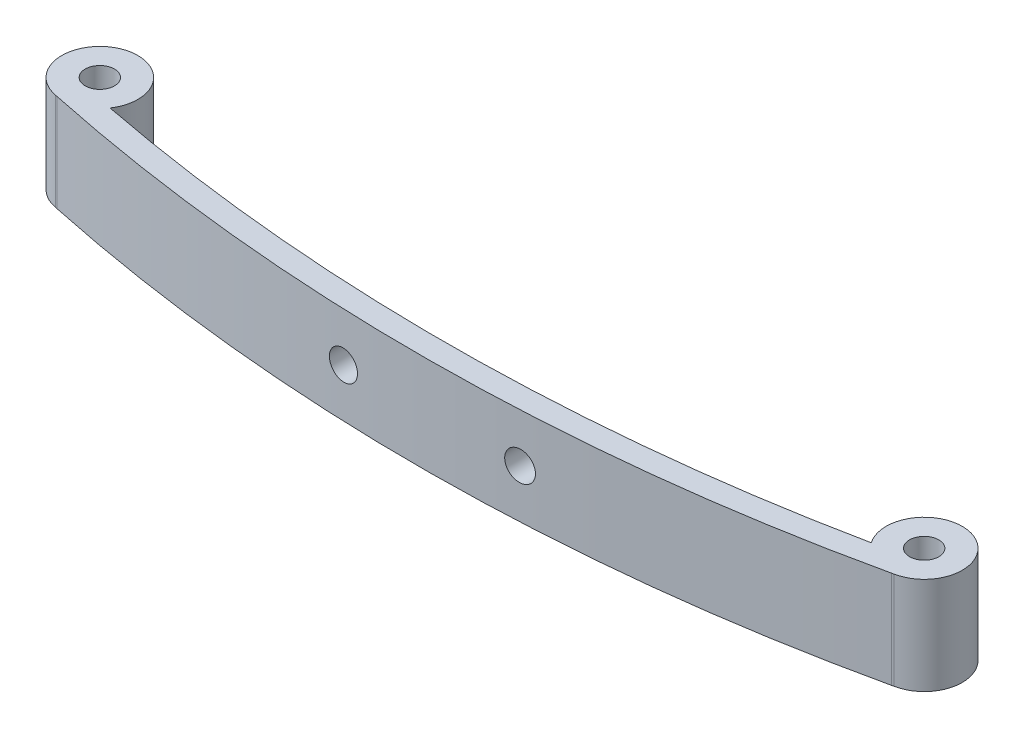
ISO-10303-21;
HEADER;
FILE_DESCRIPTION(('STEP AP214'),'2;1');
FILE_NAME('part.step','',(''),(''),'','','');
FILE_SCHEMA(('AUTOMOTIVE_DESIGN { 1 0 10303 214 1 1 1 1 }'));
ENDSEC;
DATA;
#1=APPLICATION_CONTEXT('core data for automotive mechanical design processes');
#2=APPLICATION_PROTOCOL_DEFINITION('international standard','automotive_design',2000,#1);
#3=PRODUCT_CONTEXT('',#1,'mechanical');
#4=PRODUCT('Part','Part','',(#3));
#5=PRODUCT_RELATED_PRODUCT_CATEGORY('part','',(#4));
#6=PRODUCT_DEFINITION_FORMATION('','',#4);
#7=PRODUCT_DEFINITION_CONTEXT('part definition',#1,'design');
#8=PRODUCT_DEFINITION('design','',#6,#7);
#9=PRODUCT_DEFINITION_SHAPE('','',#8);
#10=(LENGTH_UNIT() NAMED_UNIT(*) SI_UNIT(.MILLI.,.METRE.));
#11=(NAMED_UNIT(*) PLANE_ANGLE_UNIT() SI_UNIT($,.RADIAN.));
#12=(NAMED_UNIT(*) SI_UNIT($,.STERADIAN.) SOLID_ANGLE_UNIT());
#13=UNCERTAINTY_MEASURE_WITH_UNIT(LENGTH_MEASURE(1.E-05),#10,'distance_accuracy_value','');
#14=(GEOMETRIC_REPRESENTATION_CONTEXT(3) GLOBAL_UNCERTAINTY_ASSIGNED_CONTEXT((#13)) GLOBAL_UNIT_ASSIGNED_CONTEXT((#10,
#11,#12)) REPRESENTATION_CONTEXT('',''));
#15=CARTESIAN_POINT('',(0.,0.,0.));
#16=DIRECTION('',(0.,0.,1.));
#17=DIRECTION('',(1.,0.,0.));
#18=AXIS2_PLACEMENT_3D('',#15,#16,#17);
#19=CARTESIAN_POINT('',(-0.864955357142889,8.3,-164.510629845203));
#20=DIRECTION('',(0.,1.,0.));
#21=DIRECTION('',(0.,0.,1.));
#22=AXIS2_PLACEMENT_3D('',#19,#20,#21);
#23=PLANE('',#22);
#24=CARTESIAN_POINT('',(-35.,8.3,-4.14258073909656));
#25=DIRECTION('',(0.,1.,0.));
#26=DIRECTION('',(0.,0.,1.));
#27=AXIS2_PLACEMENT_3D('',#24,#25,#26);
#28=CIRCLE('',#27,1.25);
#29=CARTESIAN_POINT('',(-35.,8.3,-2.89258073909657));
#30=VERTEX_POINT('',#29);
#31=EDGE_CURVE('E134',#30,#30,#28,.T.);
#32=ORIENTED_EDGE('',*,*,#31,.F.);
#33=EDGE_LOOP('',(#32));
#34=FACE_BOUND('',#33,.T.);
#35=CARTESIAN_POINT('',(-0.864955357142889,8.3,-164.510629845203));
#36=DIRECTION('',(0.,-1.,0.));
#37=DIRECTION('',(0.,0.,1.));
#38=AXIS2_PLACEMENT_3D('',#35,#36,#37);
#39=CIRCLE('',#38,165.210703971618);
#40=CARTESIAN_POINT('',(32.3290587197964,8.3,-2.66893516717083));
#41=VERTEX_POINT('',#40);
#42=CARTESIAN_POINT('',(-32.3092176120712,8.3,-2.31989312438794));
#43=VERTEX_POINT('',#42);
#44=EDGE_CURVE('E141',#41,#43,#39,.T.);
#45=ORIENTED_EDGE('',*,*,#44,.T.);
#46=CARTESIAN_POINT('',(-35.,8.3,-4.14258073909656));
#47=DIRECTION('',(0.,1.,0.));
#48=DIRECTION('',(0.,0.,1.));
#49=AXIS2_PLACEMENT_3D('',#46,#47,#48);
#50=CIRCLE('',#49,3.25);
#51=CARTESIAN_POINT('',(-35.5757158370828,8.3,-0.943979283001734));
#52=VERTEX_POINT('',#51);
#53=EDGE_CURVE('E99',#43,#52,#50,.T.);
#54=ORIENTED_EDGE('',*,*,#53,.T.);
#55=DIRECTION('',(0.97628943196104,0.,0.216469270431603));
#56=VECTOR('',#55,1.);
#57=CARTESIAN_POINT('',(-35.413230424207,8.3,-0.907951955828518));
#58=LINE('',#57,#56);
#59=CARTESIAN_POINT('',(-35.413230424207,8.3,-0.907951955828545));
#60=VERTEX_POINT('',#59);
#61=EDGE_CURVE('E112',#52,#60,#58,.T.);
#62=ORIENTED_EDGE('',*,*,#61,.T.);
#63=CARTESIAN_POINT('',(-0.864955357142889,8.3,-164.510629845203));
#64=DIRECTION('',(0.,1.,0.));
#65=DIRECTION('',(0.,0.,1.));
#66=AXIS2_PLACEMENT_3D('',#63,#64,#65);
#67=CIRCLE('',#66,167.210703971618);
#68=CARTESIAN_POINT('',(35.4341722962853,8.3,-1.28749161325972));
#69=VERTEX_POINT('',#68);
#70=EDGE_CURVE('E106',#60,#69,#67,.T.);
#71=ORIENTED_EDGE('',*,*,#70,.T.);
#72=DIRECTION('',(0.974629450610067,0.,-0.223824560769186));
#73=VECTOR('',#72,1.);
#74=CARTESIAN_POINT('',(35.4341722962853,8.3,-1.28749161325972));
#75=LINE('',#74,#73);
#76=CARTESIAN_POINT('',(35.6227279714257,8.3,-1.33079359961198));
#77=VERTEX_POINT('',#76);
#78=EDGE_CURVE('E110',#69,#77,#75,.T.);
#79=ORIENTED_EDGE('',*,*,#78,.T.);
#80=CARTESIAN_POINT('',(35.,8.3,-4.52057570402037));
#81=DIRECTION('',(0.,1.,0.));
#82=DIRECTION('',(0.,0.,1.));
#83=AXIS2_PLACEMENT_3D('',#80,#81,#82);
#84=CIRCLE('',#83,3.25);
#85=EDGE_CURVE('E62',#77,#41,#84,.T.);
#86=ORIENTED_EDGE('',*,*,#85,.T.);
#87=EDGE_LOOP('',(#45,#54,#62,#71,#79,#86));
#88=FACE_BOUND('',#87,.T.);
#89=CARTESIAN_POINT('',(35.,8.3,-4.52057570402037));
#90=DIRECTION('',(0.,1.,0.));
#91=DIRECTION('',(0.,0.,1.));
#92=AXIS2_PLACEMENT_3D('',#89,#90,#91);
#93=CIRCLE('',#92,1.25);
#94=CARTESIAN_POINT('',(35.,8.3,-3.27057570402038));
#95=VERTEX_POINT('',#94);
#96=EDGE_CURVE('E179',#95,#95,#93,.T.);
#97=ORIENTED_EDGE('',*,*,#96,.F.);
#98=EDGE_LOOP('',(#97));
#99=FACE_BOUND('',#98,.T.);
#100=ADVANCED_FACE('F37',(#34,#88,#99),#23,.T.);
#101=CARTESIAN_POINT('',(-0.864955357142889,0.,-164.510629845203));
#102=DIRECTION('',(0.,1.,0.));
#103=DIRECTION('',(0.,0.,1.));
#104=AXIS2_PLACEMENT_3D('',#101,#102,#103);
#105=PLANE('',#104);
#106=CARTESIAN_POINT('',(-0.864955357142889,0.,-164.510629845203));
#107=DIRECTION('',(0.,-1.,0.));
#108=DIRECTION('',(0.,0.,1.));
#109=AXIS2_PLACEMENT_3D('',#106,#107,#108);
#110=CIRCLE('',#109,165.210703971618);
#111=CARTESIAN_POINT('',(32.3290587197964,0.,-2.66893516717083));
#112=VERTEX_POINT('',#111);
#113=CARTESIAN_POINT('',(-32.3092176120712,0.,-2.31989312438794));
#114=VERTEX_POINT('',#113);
#115=EDGE_CURVE('E130',#112,#114,#110,.T.);
#116=ORIENTED_EDGE('',*,*,#115,.F.);
#117=CARTESIAN_POINT('',(35.,0.,-4.52057570402037));
#118=DIRECTION('',(0.,1.,0.));
#119=DIRECTION('',(0.,0.,1.));
#120=AXIS2_PLACEMENT_3D('',#117,#118,#119);
#121=CIRCLE('',#120,3.25);
#122=CARTESIAN_POINT('',(35.6227279714257,0.,-1.33079359961198));
#123=VERTEX_POINT('',#122);
#124=EDGE_CURVE('E91',#123,#112,#121,.T.);
#125=ORIENTED_EDGE('',*,*,#124,.F.);
#126=DIRECTION('',(0.974629450610067,0.,-0.223824560769186));
#127=VECTOR('',#126,1.);
#128=CARTESIAN_POINT('',(35.4341722962853,0.,-1.28749161325972));
#129=LINE('',#128,#127);
#130=CARTESIAN_POINT('',(35.4341722962853,0.,-1.28749161325972));
#131=VERTEX_POINT('',#130);
#132=EDGE_CURVE('E85',#131,#123,#129,.T.);
#133=ORIENTED_EDGE('',*,*,#132,.F.);
#134=CARTESIAN_POINT('',(-0.864955357142889,0.,-164.510629845203));
#135=DIRECTION('',(0.,1.,0.));
#136=DIRECTION('',(0.,0.,1.));
#137=AXIS2_PLACEMENT_3D('',#134,#135,#136);
#138=CIRCLE('',#137,167.210703971618);
#139=CARTESIAN_POINT('',(-35.413230424207,0.,-0.907951955828545));
#140=VERTEX_POINT('',#139);
#141=EDGE_CURVE('E120',#140,#131,#138,.T.);
#142=ORIENTED_EDGE('',*,*,#141,.F.);
#143=DIRECTION('',(0.97628943196104,0.,0.216469270431603));
#144=VECTOR('',#143,1.);
#145=CARTESIAN_POINT('',(-35.413230424207,0.,-0.907951955828518));
#146=LINE('',#145,#144);
#147=CARTESIAN_POINT('',(-35.5757158370828,0.,-0.943979283001734));
#148=VERTEX_POINT('',#147);
#149=EDGE_CURVE('E136',#148,#140,#146,.T.);
#150=ORIENTED_EDGE('',*,*,#149,.F.);
#151=CARTESIAN_POINT('',(-35.,0.,-4.14258073909656));
#152=DIRECTION('',(0.,1.,0.));
#153=DIRECTION('',(0.,0.,1.));
#154=AXIS2_PLACEMENT_3D('',#151,#152,#153);
#155=CIRCLE('',#154,3.25);
#156=EDGE_CURVE('E133',#114,#148,#155,.T.);
#157=ORIENTED_EDGE('',*,*,#156,.F.);
#158=EDGE_LOOP('',(#116,#125,#133,#142,#150,#157));
#159=FACE_BOUND('',#158,.T.);
#160=CARTESIAN_POINT('',(-35.,0.,-4.14258073909656));
#161=DIRECTION('',(0.,1.,0.));
#162=DIRECTION('',(0.,0.,1.));
#163=AXIS2_PLACEMENT_3D('',#160,#161,#162);
#164=CIRCLE('',#163,1.25);
#165=CARTESIAN_POINT('',(-35.,0.,-2.89258073909657));
#166=VERTEX_POINT('',#165);
#167=EDGE_CURVE('E182',#166,#166,#164,.T.);
#168=ORIENTED_EDGE('',*,*,#167,.T.);
#169=EDGE_LOOP('',(#168));
#170=FACE_BOUND('',#169,.T.);
#171=CARTESIAN_POINT('',(35.,0.,-4.52057570402037));
#172=DIRECTION('',(0.,1.,0.));
#173=DIRECTION('',(0.,0.,1.));
#174=AXIS2_PLACEMENT_3D('',#171,#172,#173);
#175=CIRCLE('',#174,1.25);
#176=CARTESIAN_POINT('',(35.,0.,-3.27057570402038));
#177=VERTEX_POINT('',#176);
#178=EDGE_CURVE('E178',#177,#177,#175,.T.);
#179=ORIENTED_EDGE('',*,*,#178,.T.);
#180=EDGE_LOOP('',(#179));
#181=FACE_BOUND('',#180,.T.);
#182=ADVANCED_FACE('F198',(#159,#170,#181),#105,.F.);
#183=CARTESIAN_POINT('',(-0.864955357142889,8.3,-164.510629845203));
#184=DIRECTION('',(0.,-1.,0.));
#185=DIRECTION('',(0.,0.,-1.));
#186=AXIS2_PLACEMENT_3D('',#183,#184,#185);
#187=CYLINDRICAL_SURFACE('',#186,165.210703971618);
#188=CARTESIAN_POINT('',(8.75523546801958,4.15,0.41974526891872));
#189=CARTESIAN_POINT('',(8.75523234367771,4.22012775691496,0.419745491554456));
#190=CARTESIAN_POINT('',(8.7493140129362,4.2903063866926,0.420090990830751));
#191=CARTESIAN_POINT('',(8.72578859372263,4.42872911081155,0.421460636690887));
#192=CARTESIAN_POINT('',(8.70816743840692,4.49697077385119,0.422485599990574));
#193=CARTESIAN_POINT('',(8.66174382480419,4.62949238087325,0.425173566201312));
#194=CARTESIAN_POINT('',(8.63294714461795,4.69377435227299,0.426836239390938));
#195=CARTESIAN_POINT('',(8.56500291570541,4.81657067320099,0.430734724263326));
#196=CARTESIAN_POINT('',(8.52585789764512,4.87508642805016,0.432970395816375));
#197=CARTESIAN_POINT('',(8.43828867001005,4.98476982495955,0.437932672337795));
#198=CARTESIAN_POINT('',(8.38985599940334,5.03593069179741,0.440659724815337));
#199=CARTESIAN_POINT('',(8.28510948695568,5.12939981296102,0.446503270882601));
#200=CARTESIAN_POINT('',(8.22879527493013,5.1717076512398,0.449619782763931));
#201=CARTESIAN_POINT('',(8.10979143930163,5.24633590146088,0.45613704390323));
#202=CARTESIAN_POINT('',(8.04709214420073,5.27864085376892,0.459538222916373));
#203=CARTESIAN_POINT('',(7.91716826779515,5.33226495035966,0.466505660058124));
#204=CARTESIAN_POINT('',(7.84994366214295,5.35358403552979,0.470071919074879));
#205=CARTESIAN_POINT('',(7.71279154477582,5.38465389005854,0.477259659800095));
#206=CARTESIAN_POINT('',(7.6428609508304,5.39439104119409,0.480881201455498));
#207=CARTESIAN_POINT('',(7.50235497855954,5.40197507513718,0.488066429431124));
#208=CARTESIAN_POINT('',(7.4317795997323,5.39982194869035,0.491630115706314));
#209=CARTESIAN_POINT('',(7.29196756282965,5.38368151981341,0.498600856959138));
#210=CARTESIAN_POINT('',(7.2227312745681,5.36969099469107,0.502007869016394));
#211=CARTESIAN_POINT('',(7.08758566731119,5.33026408498481,0.508576243457887));
#212=CARTESIAN_POINT('',(7.02167634432059,5.30482771414616,0.511737606137118));
#213=CARTESIAN_POINT('',(6.89509912252421,5.24324484304104,0.517738255939391));
#214=CARTESIAN_POINT('',(6.83442816188194,5.2071046546717,0.520577731514248));
#215=CARTESIAN_POINT('',(6.72001377975751,5.12513046151643,0.525875920481087));
#216=CARTESIAN_POINT('',(6.6662703199565,5.07929651035439,0.528334635979225));
#217=CARTESIAN_POINT('',(6.56729686844673,4.97928617943602,0.532821376474635));
#218=CARTESIAN_POINT('',(6.52205816339034,4.92511844250437,0.534849842550244));
#219=CARTESIAN_POINT('',(6.44131745101904,4.80994279108891,0.53844383631376));
#220=CARTESIAN_POINT('',(6.40581539141347,4.74893491334256,0.54000936648787));
#221=CARTESIAN_POINT('',(6.34559332504817,4.62187687823517,0.54265126930583));
#222=CARTESIAN_POINT('',(6.32086252862733,4.55583184494836,0.543728131497863));
#223=CARTESIAN_POINT('',(6.28283757600977,4.42052173500274,0.545379219315388));
#224=CARTESIAN_POINT('',(6.26954337213898,4.35125667176806,0.545953447036141));
#225=CARTESIAN_POINT('',(6.25477644190879,4.21152194369805,0.546591086545572));
#226=CARTESIAN_POINT('',(6.25329588598813,4.14105310771492,0.546654836656242));
#227=CARTESIAN_POINT('',(6.26217788761156,4.00086729392074,0.546271547983102));
#228=CARTESIAN_POINT('',(6.27254042347998,3.93115031473385,0.545824510134156));
#229=CARTESIAN_POINT('',(6.30480977715857,3.79446002038941,0.544425917333555));
#230=CARTESIAN_POINT('',(6.32671451735362,3.72748621379392,0.543474453179248));
#231=CARTESIAN_POINT('',(6.38144211469525,3.59816844412159,0.541080768086543));
#232=CARTESIAN_POINT('',(6.4142649785184,3.53582448387598,0.539638546848042));
#233=CARTESIAN_POINT('',(6.48990602173823,3.41751275913382,0.536285149030597));
#234=CARTESIAN_POINT('',(6.53272751484578,3.36154711768794,0.534373816969817));
#235=CARTESIAN_POINT('',(6.62714041042641,3.257599379909,0.530114926661906));
#236=CARTESIAN_POINT('',(6.67873184655798,3.20961731421781,0.527767366740558));
#237=CARTESIAN_POINT('',(6.78926149618302,3.12295724190971,0.522678091077079));
#238=CARTESIAN_POINT('',(6.84820545871927,3.08428658612228,0.519936066637596));
#239=CARTESIAN_POINT('',(6.97173301782925,3.01738849182913,0.514116300395867));
#240=CARTESIAN_POINT('',(7.0363166398803,2.98916110050416,0.511038557076984));
#241=CARTESIAN_POINT('',(7.16936208213937,2.94391906611331,0.504614561530486));
#242=CARTESIAN_POINT('',(7.23782791441387,2.92691626117345,0.501268029980191));
#243=CARTESIAN_POINT('',(7.37663371301743,2.90464766967319,0.494393542668509));
#244=CARTESIAN_POINT('',(7.44697369404434,2.89938197518744,0.490865585484106));
#245=CARTESIAN_POINT('',(7.58760200130654,2.90073423451941,0.483721398905784));
#246=CARTESIAN_POINT('',(7.65789021504032,2.90736347919335,0.480105088860304));
#247=CARTESIAN_POINT('',(7.79635468897041,2.93233884260768,0.472894251458949));
#248=CARTESIAN_POINT('',(7.86453093753108,2.95068502588915,0.469299724223171));
#249=CARTESIAN_POINT('',(7.99686289087432,2.99858525081672,0.462244531146737));
#250=CARTESIAN_POINT('',(8.06101703624891,3.02814360859774,0.458783917422253));
#251=CARTESIAN_POINT('',(8.18344997043051,3.09763154156223,0.452113922680006));
#252=CARTESIAN_POINT('',(8.24172899851644,3.13756069413193,0.448904531431768));
#253=CARTESIAN_POINT('',(8.35071784684562,3.22663140626683,0.442851648466624));
#254=CARTESIAN_POINT('',(8.4014326748975,3.27576682185215,0.44000791484301));
#255=CARTESIAN_POINT('',(8.49390354221656,3.38189250945195,0.434787242240552));
#256=CARTESIAN_POINT('',(8.535657411412,3.43888467865759,0.432410416344335));
#257=CARTESIAN_POINT('',(8.60896038366011,3.55903345604726,0.428216332520746));
#258=CARTESIAN_POINT('',(8.64051852487354,3.62218453954559,0.426398579064002));
#259=CARTESIAN_POINT('',(8.69254686909989,3.75285329662178,0.423391944263031));
#260=CARTESIAN_POINT('',(8.71303050005948,3.82036557046379,0.422202301370124));
#261=CARTESIAN_POINT('',(8.73684790490841,3.93192653704009,0.420817000107771));
#262=CARTESIAN_POINT('',(8.74373455060982,3.97524634074798,0.420415766646807));
#263=CARTESIAN_POINT('',(8.75292930616206,4.06237080749051,0.419879831617554));
#264=CARTESIAN_POINT('',(8.75523742049632,4.10617547005032,0.419745129788268));
#265=CARTESIAN_POINT('',(8.75523546801958,4.15,0.41974526891872));
#266=B_SPLINE_CURVE_WITH_KNOTS('',3,(#188,#189,#190,#191,#192,#193,#194,#195,#196,#197,#198,
#199,#200,#201,#202,#203,#204,#205,#206,#207,#208,#209,#210,#211,#212,#213,#214,#215,#216,#217,
#218,#219,#220,#221,#222,#223,#224,#225,#226,#227,#228,#229,#230,#231,#232,#233,#234,#235,#236,
#237,#238,#239,#240,#241,#242,#243,#244,#245,#246,#247,#248,#249,#250,#251,#252,#253,#254,#255,
#256,#257,#258,#259,#260,#261,#262,#263,#264,#265),.UNSPECIFIED.,.T.,.F.,(4,2,2,2,2,2,2,2,2,2,2,
2,2,2,2,2,2,2,2,2,2,2,2,2,2,2,2,2,2,2,2,2,2,2,2,2,2,2,4),(0.,0.210223162273476,
0.420699472105275,0.631067103680404,0.841383337771128,1.05189208761873,1.26241072807794,
1.4732531232293,1.68409665286589,1.89518785139276,2.10627921421473,2.31742806445294,
2.52857666112368,2.73960099337464,2.95062415831329,3.16142993192407,3.37223457337985,
3.58282756172663,3.7934196722006,4.00387219997306,4.2143243425681,4.42473861637718,
4.63515301885741,4.8456372553737,5.05612229973341,5.26677296926159,5.47742459045928,
5.68829802413861,5.89917311206057,6.11024847170822,6.32132499404439,6.53248285304027,
6.74363210862383,6.95464094832168,7.16570083042665,7.37657309857563,7.58718910542907,
7.71856276827032,7.84993630246649),.UNSPECIFIED.);
#267=CARTESIAN_POINT('',(8.75523546801958,4.15,0.41974526891872));
#268=VERTEX_POINT('',#267);
#269=EDGE_CURVE('E172',#268,#268,#266,.T.);
#270=ORIENTED_EDGE('',*,*,#269,.T.);
#271=EDGE_LOOP('',(#270));
#272=FACE_BOUND('',#271,.T.);
#273=CARTESIAN_POINT('',(-6.24476453198042,4.15,0.61245866769935));
#274=CARTESIAN_POINT('',(-6.24476764768577,4.22018360799957,0.612458606573658));
#275=CARTESIAN_POINT('',(-6.2506953010656,4.29041808996733,0.612265770116205));
#276=CARTESIAN_POINT('',(-6.27425905692377,4.42895231746688,0.611495485977878));
#277=CARTESIAN_POINT('',(-6.29190924491371,4.497249632279,0.610917575598852));
#278=CARTESIAN_POINT('',(-6.33841377636479,4.6298820691541,0.609382563660205));
#279=CARTESIAN_POINT('',(-6.36726266776337,4.69421910163959,0.608425646614495));
#280=CARTESIAN_POINT('',(-6.43533606625281,4.81711723970539,0.60614313592235));
#281=CARTESIAN_POINT('',(-6.47455800057068,4.87567977256776,0.604817633690034));
#282=CARTESIAN_POINT('',(-6.56227848115715,4.98540692572473,0.601814073459906));
#283=CARTESIAN_POINT('',(-6.61077985440873,5.03656928319194,0.600135908007802));
#284=CARTESIAN_POINT('',(-6.71567453205909,5.13002724983261,0.596452196119219));
#285=CARTESIAN_POINT('',(-6.77206816300177,5.17232249194623,0.594446636136147));
#286=CARTESIAN_POINT('',(-6.89117358777328,5.24686649539246,0.590142255155237));
#287=CARTESIAN_POINT('',(-6.95388849684398,5.27911027082593,0.587843289411626));
#288=CARTESIAN_POINT('',(-7.08383208059165,5.33261216168597,0.582999656758561));
#289=CARTESIAN_POINT('',(-7.15106076259404,5.35387025928335,0.580454989450354));
#290=CARTESIAN_POINT('',(-7.28817028578425,5.38481219158038,0.5751773096252));
#291=CARTESIAN_POINT('',(-7.35805284066948,5.39448841169088,0.572444174445956));
#292=CARTESIAN_POINT('',(-7.49844585803743,5.40196966364717,0.566862398106028));
#293=CARTESIAN_POINT('',(-7.568956321709,5.39977467301157,0.564013756726611));
#294=CARTESIAN_POINT('',(-7.70864507353955,5.38357273188965,0.558281547366208));
#295=CARTESIAN_POINT('',(-7.77782260448696,5.369559258806,0.555397960965485));
#296=CARTESIAN_POINT('',(-7.91284266673113,5.33010905553934,0.549688100359515));
#297=CARTESIAN_POINT('',(-7.97868518865661,5.30467229325921,0.546861826315328));
#298=CARTESIAN_POINT('',(-8.10517373868071,5.24309151777392,0.541361833708983));
#299=CARTESIAN_POINT('',(-8.16581913996236,5.20694621536436,0.538688133561491));
#300=CARTESIAN_POINT('',(-8.28018042223605,5.12497250539288,0.533589762293989));
#301=CARTESIAN_POINT('',(-8.333896319487,5.07914412055134,0.531165090589679));
#302=CARTESIAN_POINT('',(-8.43284346162954,4.97912834642317,0.526657559583951));
#303=CARTESIAN_POINT('',(-8.47807903111339,4.92494524350744,0.524574526130325));
#304=CARTESIAN_POINT('',(-8.55880935877245,4.80973931783301,0.520830658354493));
#305=CARTESIAN_POINT('',(-8.59430416758756,4.74871653063453,0.51916982183739));
#306=CARTESIAN_POINT('',(-8.65450878451524,4.62162748766805,0.516339090544947));
#307=CARTESIAN_POINT('',(-8.67922916052254,4.5555662488542,0.515168714754271));
#308=CARTESIAN_POINT('',(-8.71722886753176,4.42022437094517,0.513364993445503));
#309=CARTESIAN_POINT('',(-8.73050826584511,4.35094375079329,0.512731644767886));
#310=CARTESIAN_POINT('',(-8.74523910935073,4.21119841107628,0.512028872668545));
#311=CARTESIAN_POINT('',(-8.74670147821483,4.14073484543401,0.511958928435476));
#312=CARTESIAN_POINT('',(-8.73778521208701,4.00056278292951,0.512384537772931));
#313=CARTESIAN_POINT('',(-8.72740660847319,3.93085428406689,0.512880089844912));
#314=CARTESIAN_POINT('',(-8.69510993488081,3.79419186950748,0.514415661952013));
#315=CARTESIAN_POINT('',(-8.67319524082284,3.72723715412053,0.515455522700184));
#316=CARTESIAN_POINT('',(-8.61845381955216,3.59795849519661,0.518036497642598));
#317=CARTESIAN_POINT('',(-8.58562707080556,3.53563456079833,0.519577612826019));
#318=CARTESIAN_POINT('',(-8.50997629252132,3.4173498316714,0.523099406914521));
#319=CARTESIAN_POINT('',(-8.4671469843983,3.3613924199747,0.525080317882822));
#320=CARTESIAN_POINT('',(-8.37271852774415,3.25746064161344,0.529402955656526));
#321=CARTESIAN_POINT('',(-8.32111932855012,3.20948632106967,0.531744684546336));
#322=CARTESIAN_POINT('',(-8.21055915162095,3.12283098524176,0.536702368814359));
#323=CARTESIAN_POINT('',(-8.15159079796905,3.08415939628049,0.539318598518416));
#324=CARTESIAN_POINT('',(-8.02800645590947,3.01726431362935,0.544728221132896));
#325=CARTESIAN_POINT('',(-7.96339044374867,2.98904086388524,0.547521614788427));
#326=CARTESIAN_POINT('',(-7.83028265818978,2.9438190114173,0.553192235935202));
#327=CARTESIAN_POINT('',(-7.7617875162583,2.92683053227457,0.556069535202776));
#328=CARTESIAN_POINT('',(-7.62291621998967,2.90459964323533,0.561813341153982));
#329=CARTESIAN_POINT('',(-7.55254005766644,2.89935728321633,0.564679847791733));
#330=CARTESIAN_POINT('',(-7.41188077162681,2.900768804557,0.570318268929195));
#331=CARTESIAN_POINT('',(-7.34159768448626,2.90742645846741,0.57309015314773));
#332=CARTESIAN_POINT('',(-7.20314313344426,2.93245902871143,0.578463932209329));
#333=CARTESIAN_POINT('',(-7.13497167178399,2.95083395748076,0.581065826871978));
#334=CARTESIAN_POINT('',(-7.00269614816228,2.99877619798754,0.586036468414912));
#335=CARTESIAN_POINT('',(-6.93859102162399,3.02834056606296,0.588405276408146));
#336=CARTESIAN_POINT('',(-6.81625503280144,3.09782460442871,0.592860397934622));
#337=CARTESIAN_POINT('',(-6.75802392257719,3.13774383738992,0.594946723392618));
#338=CARTESIAN_POINT('',(-6.64913113301011,3.2267736646842,0.59879747272436));
#339=CARTESIAN_POINT('',(-6.59846403095467,3.27587761694826,0.600562127409639));
#340=CARTESIAN_POINT('',(-6.50608013595014,3.38191900412738,0.603744335097544));
#341=CARTESIAN_POINT('',(-6.46436554080351,3.4388583569823,0.605161802879296));
#342=CARTESIAN_POINT('',(-6.39109870854648,3.55892531442362,0.607630181775628));
#343=CARTESIAN_POINT('',(-6.3595449049291,3.62205196314448,0.608681149396254));
#344=CARTESIAN_POINT('',(-6.30751880003737,3.75266176959088,0.610404229774605));
#345=CARTESIAN_POINT('',(-6.2870331803701,3.82013958155532,0.611076797902529));
#346=CARTESIAN_POINT('',(-6.26318937837624,3.93170687096492,0.611857581528951));
#347=CARTESIAN_POINT('',(-6.25628871271416,3.97507039631148,0.612082865842311));
#348=CARTESIAN_POINT('',(-6.24707531634483,4.062282655807,0.612383428012264));
#349=CARTESIAN_POINT('',(-6.24476258449343,4.10613138983495,0.612458705906266));
#350=CARTESIAN_POINT('',(-6.24476453198042,4.15,0.61245866769935));
#351=B_SPLINE_CURVE_WITH_KNOTS('',3,(#273,#274,#275,#276,#277,#278,#279,#280,#281,#282,#283,
#284,#285,#286,#287,#288,#289,#290,#291,#292,#293,#294,#295,#296,#297,#298,#299,#300,#301,#302,
#303,#304,#305,#306,#307,#308,#309,#310,#311,#312,#313,#314,#315,#316,#317,#318,#319,#320,#321,
#322,#323,#324,#325,#326,#327,#328,#329,#330,#331,#332,#333,#334,#335,#336,#337,#338,#339,#340,
#341,#342,#343,#344,#345,#346,#347,#348,#349,#350),.UNSPECIFIED.,.T.,.F.,(4,2,2,2,2,2,2,2,2,2,2,
2,2,2,2,2,2,2,2,2,2,2,2,2,2,2,2,2,2,2,2,2,2,2,2,2,2,2,4),(0.,0.210390669820322,
0.421034598403308,0.63157610383944,0.842065438631397,1.05261900144725,1.2631812785404,
1.47384783671978,1.68451473679911,1.89532006541143,2.10612579324162,2.31704794053302,
2.52797068047636,2.73891882379848,2.94986647215764,3.16070625216525,3.37154493604612,
3.5821763549291,3.79280653458249,4.00324198522386,4.21367687822118,4.4240502237742,
4.63442398448108,4.84490901622756,5.05539526396902,5.26609390435201,5.47679343094129,
5.68767881570359,5.89856509594632,6.10951824336319,6.32047161466818,6.5313695279413,
6.74225853556586,6.95299562113974,7.16378438274428,7.37454063110102,7.58504270753533,
7.71654846566709,7.84805419100348),.UNSPECIFIED.);
#352=CARTESIAN_POINT('',(-6.24476453198042,4.15,0.61245866769935));
#353=VERTEX_POINT('',#352);
#354=EDGE_CURVE('E152',#353,#353,#351,.T.);
#355=ORIENTED_EDGE('',*,*,#354,.T.);
#356=EDGE_LOOP('',(#355));
#357=FACE_BOUND('',#356,.T.);
#358=ORIENTED_EDGE('',*,*,#115,.T.);
#359=DIRECTION('',(0.,-1.,0.));
#360=VECTOR('',#359,1.);
#361=CARTESIAN_POINT('',(-32.3092176120712,8.3,-2.31989312438794));
#362=LINE('',#361,#360);
#363=EDGE_CURVE('E11',#43,#114,#362,.T.);
#364=ORIENTED_EDGE('',*,*,#363,.F.);
#365=ORIENTED_EDGE('',*,*,#44,.F.);
#366=DIRECTION('',(0.,-1.,0.));
#367=VECTOR('',#366,1.);
#368=CARTESIAN_POINT('',(32.3290587197964,8.3,-2.66893516717083));
#369=LINE('',#368,#367);
#370=EDGE_CURVE('E126',#41,#112,#369,.T.);
#371=ORIENTED_EDGE('',*,*,#370,.T.);
#372=EDGE_LOOP('',(#358,#364,#365,#371));
#373=FACE_BOUND('',#372,.T.);
#374=ADVANCED_FACE('F39',(#272,#357,#373),#187,.F.);
#375=CARTESIAN_POINT('',(-35.,8.3,-4.14258073909656));
#376=DIRECTION('',(0.,-1.,0.));
#377=DIRECTION('',(0.,0.,-1.));
#378=AXIS2_PLACEMENT_3D('',#375,#376,#377);
#379=CYLINDRICAL_SURFACE('',#378,3.25);
#380=ORIENTED_EDGE('',*,*,#156,.T.);
#381=DIRECTION('',(0.,-1.,0.));
#382=VECTOR('',#381,1.);
#383=CARTESIAN_POINT('',(-35.5757158370828,8.3,-0.943979283001734));
#384=LINE('',#383,#382);
#385=EDGE_CURVE('E53',#52,#148,#384,.T.);
#386=ORIENTED_EDGE('',*,*,#385,.F.);
#387=ORIENTED_EDGE('',*,*,#53,.F.);
#388=ORIENTED_EDGE('',*,*,#363,.T.);
#389=EDGE_LOOP('',(#380,#386,#387,#388));
#390=FACE_BOUND('',#389,.T.);
#391=ADVANCED_FACE('F192',(#390),#379,.T.);
#392=CARTESIAN_POINT('',(-35.413230424207,8.3,-0.907951955828518));
#393=DIRECTION('',(0.216469270431603,0.,-0.97628943196104));
#394=DIRECTION('',(-0.97628943196104,0.,-0.216469270431603));
#395=AXIS2_PLACEMENT_3D('',#392,#393,#394);
#396=PLANE('',#395);
#397=ORIENTED_EDGE('',*,*,#149,.T.);
#398=DIRECTION('',(0.,-1.,0.));
#399=VECTOR('',#398,1.);
#400=CARTESIAN_POINT('',(-35.413230424207,8.3,-0.907951955828545));
#401=LINE('',#400,#399);
#402=EDGE_CURVE('E121',#60,#140,#401,.T.);
#403=ORIENTED_EDGE('',*,*,#402,.F.);
#404=ORIENTED_EDGE('',*,*,#61,.F.);
#405=ORIENTED_EDGE('',*,*,#385,.T.);
#406=EDGE_LOOP('',(#397,#403,#404,#405));
#407=FACE_BOUND('',#406,.T.);
#408=ADVANCED_FACE('F195',(#407),#396,.F.);
#409=CARTESIAN_POINT('',(-0.864955357142889,8.3,-164.510629845203));
#410=DIRECTION('',(0.,-1.,0.));
#411=DIRECTION('',(0.,0.,-1.));
#412=AXIS2_PLACEMENT_3D('',#409,#410,#411);
#413=CYLINDRICAL_SURFACE('',#412,167.210703971618);
#414=CARTESIAN_POINT('',(8.75523546801958,4.15,2.42310386722372));
#415=CARTESIAN_POINT('',(8.75523234393409,4.07987021372099,2.4231040871745));
#416=CARTESIAN_POINT('',(8.74931367427641,4.00968955370264,2.42344545968196));
#417=CARTESIAN_POINT('',(8.72578686387223,3.87126278266572,2.42479874861225));
#418=CARTESIAN_POINT('',(8.708164655379,3.80301910297613,2.4258114720015));
#419=CARTESIAN_POINT('',(8.66173811387968,3.67049349362039,2.42846734802699));
#420=CARTESIAN_POINT('',(8.63293954899056,3.60620954013766,2.43011017546145));
#421=CARTESIAN_POINT('',(8.56499064879712,3.48340953715238,2.43396214071584));
#422=CARTESIAN_POINT('',(8.52584284540266,3.42489208169377,2.43617114001951));
#423=CARTESIAN_POINT('',(8.43826797252982,3.31520689088853,2.44107418222038));
#424=CARTESIAN_POINT('',(8.38983261938769,3.26404578857397,2.44376865798866));
#425=CARTESIAN_POINT('',(8.28508020558082,3.17057671654628,2.44954240470818));
#426=CARTESIAN_POINT('',(8.22876277614541,3.12826916128627,2.45262169366257));
#427=CARTESIAN_POINT('',(8.10975432809807,3.05364363890487,2.45906099642495));
#428=CARTESIAN_POINT('',(8.04705387064028,3.02134075979767,2.46242142461832));
#429=CARTESIAN_POINT('',(7.91712783807551,2.96772095411992,2.46930537268909));
#430=CARTESIAN_POINT('',(7.84990223941741,2.94640408473109,2.47282889341527));
#431=CARTESIAN_POINT('',(7.71275037431824,2.91533928374505,2.47993038214875));
#432=CARTESIAN_POINT('',(7.64282109942733,2.90560464623511,2.48350840795742));
#433=CARTESIAN_POINT('',(7.50231823367187,2.89802510421588,2.49060728374273));
#434=CARTESIAN_POINT('',(7.43174464234576,2.90018020822446,2.49412813367841));
#435=CARTESIAN_POINT('',(7.29193707433314,2.91632387996302,2.50101504687116));
#436=CARTESIAN_POINT('',(7.22270345869407,2.93031559280553,2.50438106873812));
#437=CARTESIAN_POINT('',(7.08756346510807,2.96974392017249,2.51087040703797));
#438=CARTESIAN_POINT('',(7.02165708334386,2.99518052156609,2.51399372374932));
#439=CARTESIAN_POINT('',(6.89508489662199,3.05676321306135,2.51992219340365));
#440=CARTESIAN_POINT('',(6.834416102449,3.09290314163335,2.52272752811649));
#441=CARTESIAN_POINT('',(6.72000600375099,3.17487595375888,2.52796200944081));
#442=CARTESIAN_POINT('',(6.66626466175541,3.22070878488,2.53039115808711));
#443=CARTESIAN_POINT('',(6.56729389686175,3.32071724513383,2.53482400202353));
#444=CARTESIAN_POINT('',(6.52205596831894,3.37488443799597,2.53682812271332));
#445=CARTESIAN_POINT('',(6.44131669160088,3.49005854295913,2.54037898136648));
#446=CARTESIAN_POINT('',(6.40581529241468,3.55106541922381,2.54192572172612));
#447=CARTESIAN_POINT('',(6.3455935156642,3.67812259602396,2.54453595272748));
#448=CARTESIAN_POINT('',(6.32086260559468,3.74416789483442,2.5455999155222));
#449=CARTESIAN_POINT('',(6.2828375286557,3.8794784198371,2.54723122351512));
#450=CARTESIAN_POINT('',(6.26954331523637,3.94874363292235,2.54779857073464));
#451=CARTESIAN_POINT('',(6.25477629157968,4.08847971243055,2.54842857348637));
#452=CARTESIAN_POINT('',(6.25329583815287,4.1589497697671,2.54849155532969));
#453=CARTESIAN_POINT('',(6.26217845300096,4.29913799703031,2.54811283337948));
#454=CARTESIAN_POINT('',(6.27254150012781,4.36885616829934,2.54767113048713));
#455=CARTESIAN_POINT('',(6.30481238105322,4.50554908716487,2.54628923130977));
#456=CARTESIAN_POINT('',(6.32671818666046,4.57252431449974,2.54534912260005));
#457=CARTESIAN_POINT('',(6.38144849261314,4.70184476817846,2.54298400336271));
#458=CARTESIAN_POINT('',(6.41427299944246,4.76418999177284,2.54155899254715));
#459=CARTESIAN_POINT('',(6.48991764752588,4.88250349391281,2.53824561957326));
#460=CARTESIAN_POINT('',(6.53274102386597,4.93846969981805,2.53635710744119));
#461=CARTESIAN_POINT('',(6.62715818508893,5.04241824496493,2.53214906035685));
#462=CARTESIAN_POINT('',(6.67875200291796,5.09040055421372,2.52982952378544));
#463=CARTESIAN_POINT('',(6.78928586530496,5.17705979715013,2.52480104072049));
#464=CARTESIAN_POINT('',(6.84823152258662,5.2157295543912,2.52209179646172));
#465=CARTESIAN_POINT('',(6.97176267522426,5.28262554334392,2.51634160399607));
#466=CARTESIAN_POINT('',(7.03634819531376,5.31085172925262,2.5133006543345));
#467=CARTESIAN_POINT('',(7.16939587643223,5.35609032306653,2.50695353829952));
#468=CARTESIAN_POINT('',(7.23786195411499,5.37309117422248,2.50364710251635));
#469=CARTESIAN_POINT('',(7.37666812097241,5.39535587496249,2.4968549921724));
#470=CARTESIAN_POINT('',(7.44700822457516,5.40061963415651,2.49336931623146));
#471=CARTESIAN_POINT('',(7.58763495419046,5.39926350448543,2.48631084758957));
#472=CARTESIAN_POINT('',(7.6579214701767,5.39263259448291,2.48273797712353));
#473=CARTESIAN_POINT('',(7.79638232953215,5.36765445972989,2.47561377944634));
#474=CARTESIAN_POINT('',(7.86455666144166,5.34930717142361,2.47206245235217));
#475=CARTESIAN_POINT('',(7.99688399966966,5.30140559871852,2.46509210597211));
#476=CARTESIAN_POINT('',(8.06103548215499,5.27184709710112,2.46167313700816));
#477=CARTESIAN_POINT('',(8.18346310020375,5.20235983144462,2.45508342885862));
#478=CARTESIAN_POINT('',(8.24173947484218,5.16243148962072,2.45191267957343));
#479=CARTESIAN_POINT('',(8.3507239704937,5.07336284405367,2.445932647814));
#480=CARTESIAN_POINT('',(8.40143699929149,5.02422856108074,2.44312313110397));
#481=CARTESIAN_POINT('',(8.49390454754776,4.91810599082919,2.43796528186717));
#482=CARTESIAN_POINT('',(8.53565689557396,4.86111580532052,2.43561706113742));
#483=CARTESIAN_POINT('',(8.60895860285928,4.74096982416913,2.4314733761217));
#484=CARTESIAN_POINT('',(8.64051666920306,4.67781935047058,2.42967744018456));
#485=CARTESIAN_POINT('',(8.69254500346459,4.54715215755676,2.42670688669826));
#486=CARTESIAN_POINT('',(8.71302869591232,4.47964083632493,2.42553151692976));
#487=CARTESIAN_POINT('',(8.73684685127319,4.36807967560475,2.42416279734726));
#488=CARTESIAN_POINT('',(8.74373389361009,4.32475863097923,2.42376635621305));
#489=CARTESIAN_POINT('',(8.75292917595242,4.23763167983014,2.42323682255091));
#490=CARTESIAN_POINT('',(8.75523742033501,4.19382577377013,2.42310372977123));
#491=CARTESIAN_POINT('',(8.75523546801958,4.15,2.42310386722372));
#492=B_SPLINE_CURVE_WITH_KNOTS('',3,(#414,#415,#416,#417,#418,#419,#420,#421,#422,#423,#424,
#425,#426,#427,#428,#429,#430,#431,#432,#433,#434,#435,#436,#437,#438,#439,#440,#441,#442,#443,
#444,#445,#446,#447,#448,#449,#450,#451,#452,#453,#454,#455,#456,#457,#458,#459,#460,#461,#462,
#463,#464,#465,#466,#467,#468,#469,#470,#471,#472,#473,#474,#475,#476,#477,#478,#479,#480,#481,
#482,#483,#484,#485,#486,#487,#488,#489,#490,#491),.UNSPECIFIED.,.T.,.F.,(4,2,2,2,2,2,2,2,2,2,2,
2,2,2,2,2,2,2,2,2,2,2,2,2,2,2,2,2,2,2,2,2,2,2,2,2,2,2,4),(0.,0.210229249381413,
0.420711654453406,0.631085573719977,0.841408073196732,1.05191904149802,1.26243986205596,
1.47327663947678,1.68411451428285,1.89519415608734,2.10627394911052,2.31740984589634,
2.52854550044438,2.73955984707875,2.95057305228923,3.16137405248112,3.37217394823815,
3.58276723648951,3.79335966757599,4.00381583988844,4.21427163640572,4.42469046581919,
4.63510942018648,4.84559654916046,5.05608446884676,5.26673407954437,5.4773846140888,
5.68825168161915,5.89912037307949,6.11018454819184,6.32124986823684,6.532394661641,
6.74353085948672,6.95452945129024,7.16557911656935,7.37644804168324,7.58706077174476,
7.71843816243448,7.84981542753264),.UNSPECIFIED.);
#493=CARTESIAN_POINT('',(8.75523546801958,4.15,2.42310386722372));
#494=VERTEX_POINT('',#493);
#495=EDGE_CURVE('E42',#494,#494,#492,.T.);
#496=ORIENTED_EDGE('',*,*,#495,.T.);
#497=EDGE_LOOP('',(#496));
#498=FACE_BOUND('',#497,.T.);
#499=CARTESIAN_POINT('',(-6.24476453198042,4.15,2.61350717852638));
#500=CARTESIAN_POINT('',(-6.24476764763452,4.07981569177624,2.61350711813503));
#501=CARTESIAN_POINT('',(-6.25069541824629,4.00958050871324,2.61331658682089));
#502=CARTESIAN_POINT('',(-6.27425965373987,3.87104488782541,2.61255551014536));
#503=CARTESIAN_POINT('',(-6.29191020460116,3.80274688076298,2.61198450761073));
#504=CARTESIAN_POINT('',(-6.33841574020668,3.67011307914621,2.61046784237575));
#505=CARTESIAN_POINT('',(-6.36726527514343,3.60577537498985,2.60952236190459));
#506=CARTESIAN_POINT('',(-6.43534027472261,3.48287597850314,2.60726712793653));
#507=CARTESIAN_POINT('',(-6.47456316634285,3.42431285877502,2.60595746476788));
#508=CARTESIAN_POINT('',(-6.56228569557266,3.31458495724656,2.602989798743));
#509=CARTESIAN_POINT('',(-6.61078811610817,3.26342240297552,2.60133169137382));
#510=CARTESIAN_POINT('',(-6.71568516823885,3.16996422679732,2.59769200523853));
#511=CARTESIAN_POINT('',(-6.7720801259916,3.12766897151011,2.59571041310392));
#512=CARTESIAN_POINT('',(-6.89118774057201,3.05312569691017,2.59145749490883));
#513=CARTESIAN_POINT('',(-6.95390343588442,3.02088254058937,2.5891860293603));
#514=CARTESIAN_POINT('',(-7.08384869661218,2.96738203494425,2.58440033618483));
#515=CARTESIAN_POINT('',(-7.15107826896393,2.94612470250211,2.58188610818484));
#516=CARTESIAN_POINT('',(-7.28818854497811,2.91518477629383,2.57667160255984));
#517=CARTESIAN_POINT('',(-7.35807092170486,2.90550961660633,2.57397120661653));
#518=CARTESIAN_POINT('',(-7.49846351663018,2.89803040383163,2.56845629885302));
#519=CARTESIAN_POINT('',(-7.56897373596236,2.90022637218268,2.56564178682676));
#520=CARTESIAN_POINT('',(-7.70866095500882,2.91643008551424,2.55997830139116));
#521=CARTESIAN_POINT('',(-7.77783721547181,2.93044419775542,2.55712931022122));
#522=CARTESIAN_POINT('',(-7.91285466047551,2.96989526144149,2.5514879635445));
#523=CARTESIAN_POINT('',(-7.97869583578495,2.99533224450208,2.54869560819449));
#524=CARTESIAN_POINT('',(-8.10518146930667,3.05691289181758,2.54326164117717));
#525=CARTESIAN_POINT('',(-8.16582531581913,3.09305781411876,2.54062004726592));
#526=CARTESIAN_POINT('',(-8.28018358502333,3.17503015905589,2.5355829059433));
#527=CARTESIAN_POINT('',(-8.3338980236546,3.22085755941883,2.53318735796595));
#528=CARTESIAN_POINT('',(-8.43284310790768,3.32087133861629,2.52873394362651));
#529=CARTESIAN_POINT('',(-8.47807797526703,3.37505353321482,2.52667590929017));
#530=CARTESIAN_POINT('',(-8.55880711368273,3.49025719487215,2.52297697162326));
#531=CARTESIAN_POINT('',(-8.59430143413778,3.55127862724387,2.52133606617723));
#532=CARTESIAN_POINT('',(-8.65450617481114,3.67836607629252,2.51853926199453));
#533=CARTESIAN_POINT('',(-8.67922691110614,3.7444271957404,2.51738289933257));
#534=CARTESIAN_POINT('',(-8.71722734043818,3.87976873400175,2.51560076654338));
#535=CARTESIAN_POINT('',(-8.73050709919251,3.94904913432118,2.51497499336842));
#536=CARTESIAN_POINT('',(-8.74523889157661,4.08879557428338,2.51428060123367));
#537=CARTESIAN_POINT('',(-8.74670158882262,4.15926048746724,2.51421147995609));
#538=CARTESIAN_POINT('',(-8.73778552079609,4.29943529195725,2.51463197787375));
#539=CARTESIAN_POINT('',(-8.72740678614544,4.3691451852154,2.51512159562409));
#540=CARTESIAN_POINT('',(-8.69510923105619,4.50581088766724,2.51663880141682));
#541=CARTESIAN_POINT('',(-8.67319370638823,4.57276747752397,2.51766623581804));
#542=CARTESIAN_POINT('',(-8.61844990154128,4.70204974967711,2.52021638257286));
#543=CARTESIAN_POINT('',(-8.585621600373,4.76437542306628,2.52173909587905));
#544=CARTESIAN_POINT('',(-8.50996744551258,4.88266256966092,2.52521882823192));
#545=CARTESIAN_POINT('',(-8.46713643857234,4.93862074024649,2.52717607111617));
#546=CARTESIAN_POINT('',(-8.37270408354792,5.042553702756,2.53144706883029));
#547=CARTESIAN_POINT('',(-8.32110268591502,5.09052844957419,2.5337608256743));
#548=CARTESIAN_POINT('',(-8.21053902003051,5.17718306489054,2.53865923613787));
#549=CARTESIAN_POINT('',(-8.15156955099035,5.2158537308751,2.54124415436041));
#550=CARTESIAN_POINT('',(-8.02798296458415,5.28274677503997,2.54658903142544));
#551=CARTESIAN_POINT('',(-7.9633658241709,5.31096911057992,2.54934899098224));
#552=CARTESIAN_POINT('',(-7.83025728405827,5.35618799691474,2.5549516764405));
#553=CARTESIAN_POINT('',(-7.76176259618851,5.37317486038288,2.55779447156472));
#554=CARTESIAN_POINT('',(-7.62289249535442,5.39540275077854,2.56346939156877));
#555=CARTESIAN_POINT('',(-7.55251707451491,5.40064372851477,2.56630151640388));
#556=CARTESIAN_POINT('',(-7.41186011049652,5.39922974497185,2.57187227961958));
#557=CARTESIAN_POINT('',(-7.34157860310877,5.39257110185465,2.57461088879848));
#558=CARTESIAN_POINT('',(-7.20312743929177,5.36753712330332,2.57992015291074));
#559=CARTESIAN_POINT('',(-7.1349577851515,5.34916177517024,2.58249080766206));
#560=CARTESIAN_POINT('',(-7.00268553786994,5.30121919069443,2.58740178194691));
#561=CARTESIAN_POINT('',(-6.9385819071868,5.27165482301786,2.5897421603256));
#562=CARTESIAN_POINT('',(-6.81624892630929,5.2021713613184,2.59414381112778));
#563=CARTESIAN_POINT('',(-6.75801932858931,5.1622527038678,2.59620509531325));
#564=CARTESIAN_POINT('',(-6.64912860093049,5.07322396802057,2.60000965532197));
#565=CARTESIAN_POINT('',(-6.59846215865199,5.02412039622446,2.60175315454857));
#566=CARTESIAN_POINT('',(-6.50607950650026,4.91808011108674,2.60489721264523));
#567=CARTESIAN_POINT('',(-6.4643654951236,4.86114147926858,2.6062976872888));
#568=CARTESIAN_POINT('',(-6.3910990657259,4.74107535982689,2.60873649587853));
#569=CARTESIAN_POINT('',(-6.35954523393632,4.67794873484612,2.60977488021051));
#570=CARTESIAN_POINT('',(-6.30751908747417,4.54733907968741,2.61147733015128));
#571=CARTESIAN_POINT('',(-6.28703345519606,4.47986139481549,2.61214184565077));
#572=CARTESIAN_POINT('',(-6.26318953709978,4.36829406550711,2.6129132843142));
#573=CARTESIAN_POINT('',(-6.25628881130747,4.32493034925546,2.6131358731343));
#574=CARTESIAN_POINT('',(-6.24707533558438,4.23771771400659,2.61343283909619));
#575=CARTESIAN_POINT('',(-6.24476258453668,4.19386879512749,2.61350721627406));
#576=CARTESIAN_POINT('',(-6.24476453198042,4.15,2.61350717852638));
#577=B_SPLINE_CURVE_WITH_KNOTS('',3,(#499,#500,#501,#502,#503,#504,#505,#506,#507,#508,#509,
#510,#511,#512,#513,#514,#515,#516,#517,#518,#519,#520,#521,#522,#523,#524,#525,#526,#527,#528,
#529,#530,#531,#532,#533,#534,#535,#536,#537,#538,#539,#540,#541,#542,#543,#544,#545,#546,#547,
#548,#549,#550,#551,#552,#553,#554,#555,#556,#557,#558,#559,#560,#561,#562,#563,#564,#565,#566,
#567,#568,#569,#570,#571,#572,#573,#574,#575,#576),.UNSPECIFIED.,.T.,.F.,(4,2,2,2,2,2,2,2,2,2,2,
2,2,2,2,2,2,2,2,2,2,2,2,2,2,2,2,2,2,2,2,2,2,2,2,2,2,2,4),(0.,0.210392770625161,
0.421038805652867,0.631582461383314,0.84207394246461,1.05262864906595,1.26319205937069,
1.47385717827179,1.68452262090625,1.89532320789016,2.106124175562,2.31703878907186,
2.52795398634546,2.7388939732984,2.94983347502264,3.16066767540333,3.37150080652877,
3.58213161174723,3.79276120708837,4.00320071081211,4.21363967034139,4.42401854535271,
4.63439782500278,4.84488572902071,5.05537482223944,5.26607125869649,5.47676855501067,
5.68764728046445,5.89852688906779,6.1094717568088,6.3204168531791,6.53130790356499,
6.74219006350723,6.95292339627524,7.16370842089318,7.37446410251156,7.58496562831002,
7.71647194120765,7.8479782220908),.UNSPECIFIED.);
#578=CARTESIAN_POINT('',(-6.24476453198042,4.15,2.61350717852638));
#579=VERTEX_POINT('',#578);
#580=EDGE_CURVE('E146',#579,#579,#577,.T.);
#581=ORIENTED_EDGE('',*,*,#580,.T.);
#582=EDGE_LOOP('',(#581));
#583=FACE_BOUND('',#582,.T.);
#584=ORIENTED_EDGE('',*,*,#141,.T.);
#585=DIRECTION('',(0.,-1.,0.));
#586=VECTOR('',#585,1.);
#587=CARTESIAN_POINT('',(35.4341722962853,8.3,-1.28749161325972));
#588=LINE('',#587,#586);
#589=EDGE_CURVE('E117',#69,#131,#588,.T.);
#590=ORIENTED_EDGE('',*,*,#589,.F.);
#591=ORIENTED_EDGE('',*,*,#70,.F.);
#592=ORIENTED_EDGE('',*,*,#402,.T.);
#593=EDGE_LOOP('',(#584,#590,#591,#592));
#594=FACE_BOUND('',#593,.T.);
#595=ADVANCED_FACE('F118',(#498,#583,#594),#413,.T.);
#596=CARTESIAN_POINT('',(35.4341722962853,8.3,-1.28749161325972));
#597=DIRECTION('',(-0.223824560769186,0.,-0.974629450610067));
#598=DIRECTION('',(-0.974629450610067,0.,0.223824560769186));
#599=AXIS2_PLACEMENT_3D('',#596,#597,#598);
#600=PLANE('',#599);
#601=ORIENTED_EDGE('',*,*,#132,.T.);
#602=DIRECTION('',(0.,-1.,0.));
#603=VECTOR('',#602,1.);
#604=CARTESIAN_POINT('',(35.6227279714257,8.3,-1.33079359961198));
#605=LINE('',#604,#603);
#606=EDGE_CURVE('E122',#77,#123,#605,.T.);
#607=ORIENTED_EDGE('',*,*,#606,.F.);
#608=ORIENTED_EDGE('',*,*,#78,.F.);
#609=ORIENTED_EDGE('',*,*,#589,.T.);
#610=EDGE_LOOP('',(#601,#607,#608,#609));
#611=FACE_BOUND('',#610,.T.);
#612=ADVANCED_FACE('F124',(#611),#600,.F.);
#613=CARTESIAN_POINT('',(35.,8.3,-4.52057570402037));
#614=DIRECTION('',(0.,-1.,0.));
#615=DIRECTION('',(0.,0.,-1.));
#616=AXIS2_PLACEMENT_3D('',#613,#614,#615);
#617=CYLINDRICAL_SURFACE('',#616,3.25);
#618=ORIENTED_EDGE('',*,*,#124,.T.);
#619=ORIENTED_EDGE('',*,*,#370,.F.);
#620=ORIENTED_EDGE('',*,*,#85,.F.);
#621=ORIENTED_EDGE('',*,*,#606,.T.);
#622=EDGE_LOOP('',(#618,#619,#620,#621));
#623=FACE_BOUND('',#622,.T.);
#624=ADVANCED_FACE('F201',(#623),#617,.T.);
#625=CARTESIAN_POINT('',(-35.,8.3,-4.14258073909656));
#626=DIRECTION('',(0.,-1.,0.));
#627=DIRECTION('',(0.,0.,-1.));
#628=AXIS2_PLACEMENT_3D('',#625,#626,#627);
#629=CYLINDRICAL_SURFACE('',#628,1.25);
#630=ORIENTED_EDGE('',*,*,#31,.T.);
#631=EDGE_LOOP('',(#630));
#632=FACE_BOUND('',#631,.T.);
#633=ORIENTED_EDGE('',*,*,#167,.F.);
#634=EDGE_LOOP('',(#633));
#635=FACE_BOUND('',#634,.T.);
#636=ADVANCED_FACE('F203',(#632,#635),#629,.F.);
#637=CARTESIAN_POINT('',(35.,8.3,-4.52057570402037));
#638=DIRECTION('',(0.,-1.,0.));
#639=DIRECTION('',(0.,0.,-1.));
#640=AXIS2_PLACEMENT_3D('',#637,#638,#639);
#641=CYLINDRICAL_SURFACE('',#640,1.25);
#642=ORIENTED_EDGE('',*,*,#96,.T.);
#643=EDGE_LOOP('',(#642));
#644=FACE_BOUND('',#643,.T.);
#645=ORIENTED_EDGE('',*,*,#178,.F.);
#646=EDGE_LOOP('',(#645));
#647=FACE_BOUND('',#646,.T.);
#648=ADVANCED_FACE('F161',(#644,#647),#641,.F.);
#649=CARTESIAN_POINT('',(-7.49476453198042,4.15,-7.77057570402037));
#650=DIRECTION('',(0.,0.,1.));
#651=DIRECTION('',(1.,0.,0.));
#652=AXIS2_PLACEMENT_3D('',#649,#650,#651);
#653=CYLINDRICAL_SURFACE('',#652,1.25);
#654=ORIENTED_EDGE('',*,*,#580,.F.);
#655=EDGE_LOOP('',(#654));
#656=FACE_BOUND('',#655,.T.);
#657=ORIENTED_EDGE('',*,*,#354,.F.);
#658=EDGE_LOOP('',(#657));
#659=FACE_BOUND('',#658,.T.);
#660=ADVANCED_FACE('F156',(#656,#659),#653,.F.);
#661=CARTESIAN_POINT('',(7.50523546801958,4.15,-7.77057570402037));
#662=DIRECTION('',(0.,0.,1.));
#663=DIRECTION('',(1.,0.,0.));
#664=AXIS2_PLACEMENT_3D('',#661,#662,#663);
#665=CYLINDRICAL_SURFACE('',#664,1.25);
#666=ORIENTED_EDGE('',*,*,#495,.F.);
#667=EDGE_LOOP('',(#666));
#668=FACE_BOUND('',#667,.T.);
#669=ORIENTED_EDGE('',*,*,#269,.F.);
#670=EDGE_LOOP('',(#669));
#671=FACE_BOUND('',#670,.T.);
#672=ADVANCED_FACE('F160',(#668,#671),#665,.F.);
#673=CLOSED_SHELL('',(#100,#182,#374,#391,#408,#595,#612,#624,#636,#648,#660,#672));
#674=MANIFOLD_SOLID_BREP('B2',#673);
#675=ADVANCED_BREP_SHAPE_REPRESENTATION('',(#18,#674),#14);
#676=SHAPE_DEFINITION_REPRESENTATION(#9,#675);
ENDSEC;
END-ISO-10303-21;
